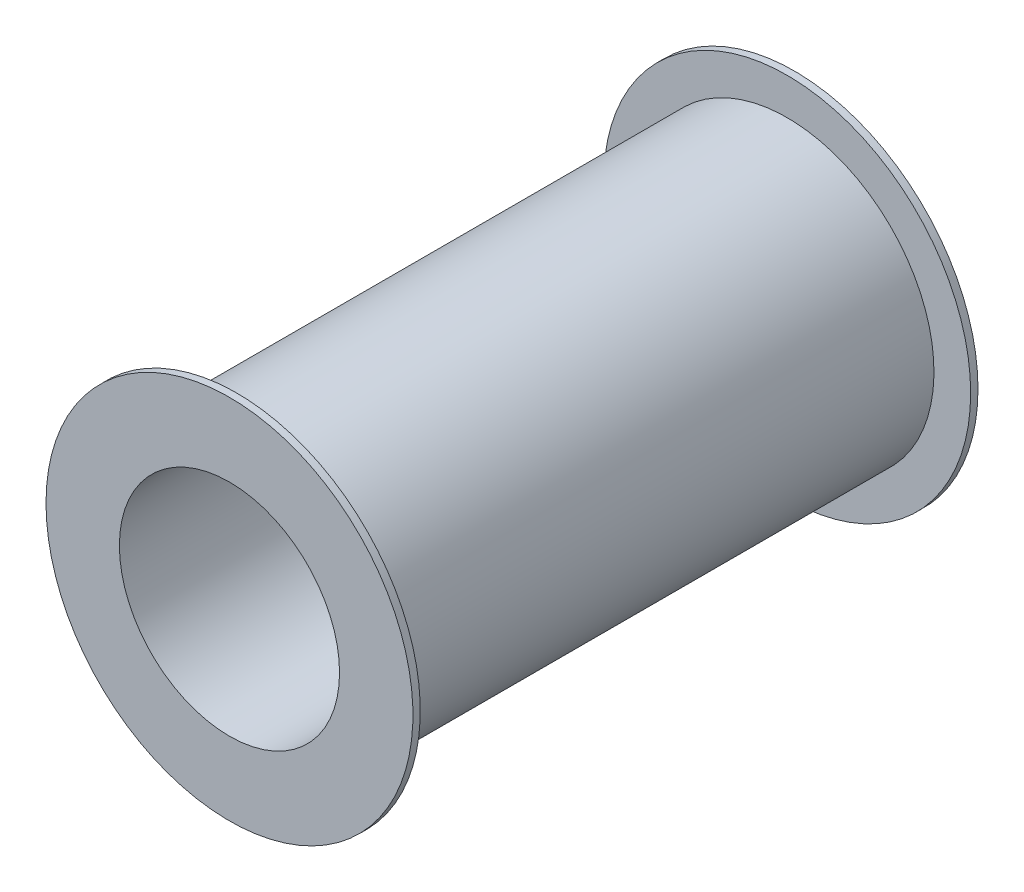
ISO-10303-21;
HEADER;
FILE_DESCRIPTION(('STEP AP214'),'2;1');
FILE_NAME('part.step','',(''),(''),'','','');
FILE_SCHEMA(('AUTOMOTIVE_DESIGN { 1 0 10303 214 1 1 1 1 }'));
ENDSEC;
DATA;
#1=APPLICATION_CONTEXT('core data for automotive mechanical design processes');
#2=APPLICATION_PROTOCOL_DEFINITION('international standard','automotive_design',2000,#1);
#3=PRODUCT_CONTEXT('',#1,'mechanical');
#4=PRODUCT('Part','Part','',(#3));
#5=PRODUCT_RELATED_PRODUCT_CATEGORY('part','',(#4));
#6=PRODUCT_DEFINITION_FORMATION('','',#4);
#7=PRODUCT_DEFINITION_CONTEXT('part definition',#1,'design');
#8=PRODUCT_DEFINITION('design','',#6,#7);
#9=PRODUCT_DEFINITION_SHAPE('','',#8);
#10=(LENGTH_UNIT() NAMED_UNIT(*) SI_UNIT(.MILLI.,.METRE.));
#11=(NAMED_UNIT(*) PLANE_ANGLE_UNIT() SI_UNIT($,.RADIAN.));
#12=(NAMED_UNIT(*) SI_UNIT($,.STERADIAN.) SOLID_ANGLE_UNIT());
#13=UNCERTAINTY_MEASURE_WITH_UNIT(LENGTH_MEASURE(1.E-05),#10,'distance_accuracy_value','');
#14=(GEOMETRIC_REPRESENTATION_CONTEXT(3) GLOBAL_UNCERTAINTY_ASSIGNED_CONTEXT((#13)) GLOBAL_UNIT_ASSIGNED_CONTEXT((#10,
#11,#12)) REPRESENTATION_CONTEXT('',''));
#15=CARTESIAN_POINT('',(0.,0.,0.));
#16=DIRECTION('',(0.,0.,1.));
#17=DIRECTION('',(1.,0.,0.));
#18=AXIS2_PLACEMENT_3D('',#15,#16,#17);
#19=CARTESIAN_POINT('',(8.125,-4.2,-7.02));
#20=DIRECTION('',(0.,0.,1.));
#21=DIRECTION('',(1.,0.,0.));
#22=AXIS2_PLACEMENT_3D('',#19,#20,#21);
#23=CYLINDRICAL_SURFACE('',#22,0.5);
#24=CARTESIAN_POINT('',(8.125,-4.2,-7.));
#25=DIRECTION('',(0.,0.,1.));
#26=DIRECTION('',(1.,0.,0.));
#27=AXIS2_PLACEMENT_3D('',#24,#25,#26);
#28=CIRCLE('',#27,0.5);
#29=CARTESIAN_POINT('',(8.625,-4.2,-7.));
#30=VERTEX_POINT('',#29);
#31=EDGE_CURVE('E41',#30,#30,#28,.T.);
#32=ORIENTED_EDGE('',*,*,#31,.F.);
#33=EDGE_LOOP('',(#32));
#34=FACE_BOUND('',#33,.T.);
#35=CARTESIAN_POINT('',(8.125,-4.2,-7.02));
#36=DIRECTION('',(0.,0.,1.));
#37=DIRECTION('',(1.,0.,0.));
#38=AXIS2_PLACEMENT_3D('',#35,#36,#37);
#39=CIRCLE('',#38,0.5);
#40=CARTESIAN_POINT('',(8.625,-4.2,-7.02));
#41=VERTEX_POINT('',#40);
#42=EDGE_CURVE('E19',#41,#41,#39,.F.);
#43=ORIENTED_EDGE('',*,*,#42,.F.);
#44=EDGE_LOOP('',(#43));
#45=FACE_BOUND('',#44,.T.);
#46=ADVANCED_FACE('F15',(#34,#45),#23,.T.);
#47=CARTESIAN_POINT('',(7.624,-3.699,-7.02));
#48=DIRECTION('',(0.,0.,-1.));
#49=DIRECTION('',(1.,0.,0.));
#50=AXIS2_PLACEMENT_3D('',#47,#48,#49);
#51=PLANE('',#50);
#52=CARTESIAN_POINT('',(8.12500000000001,-4.2,-7.02));
#53=DIRECTION('',(0.,0.,-1.));
#54=DIRECTION('',(-1.,0.,0.));
#55=AXIS2_PLACEMENT_3D('',#52,#53,#54);
#56=CIRCLE('',#55,0.299999999999995);
#57=CARTESIAN_POINT('',(7.82500000000002,-4.2,-7.02));
#58=VERTEX_POINT('',#57);
#59=EDGE_CURVE('E39',#58,#58,#56,.T.);
#60=ORIENTED_EDGE('',*,*,#59,.F.);
#61=EDGE_LOOP('',(#60));
#62=FACE_BOUND('',#61,.T.);
#63=ORIENTED_EDGE('',*,*,#42,.T.);
#64=EDGE_LOOP('',(#63));
#65=FACE_BOUND('',#64,.T.);
#66=ADVANCED_FACE('F48',(#62,#65),#51,.T.);
#67=CARTESIAN_POINT('',(8.626,-3.699,-7.));
#68=DIRECTION('',(0.,0.,1.));
#69=DIRECTION('',(-1.,0.,0.));
#70=AXIS2_PLACEMENT_3D('',#67,#68,#69);
#71=PLANE('',#70);
#72=CARTESIAN_POINT('',(8.12500000000001,-4.2,-7.));
#73=DIRECTION('',(0.,0.,1.));
#74=DIRECTION('',(0.,-1.,0.));
#75=AXIS2_PLACEMENT_3D('',#72,#73,#74);
#76=CIRCLE('',#75,0.399999999999999);
#77=CARTESIAN_POINT('',(8.12500000000001,-4.6,-7.));
#78=VERTEX_POINT('',#77);
#79=EDGE_CURVE('E36',#78,#78,#76,.T.);
#80=ORIENTED_EDGE('',*,*,#79,.F.);
#81=EDGE_LOOP('',(#80));
#82=FACE_BOUND('',#81,.T.);
#83=ORIENTED_EDGE('',*,*,#31,.T.);
#84=EDGE_LOOP('',(#83));
#85=FACE_BOUND('',#84,.T.);
#86=ADVANCED_FACE('F57',(#82,#85),#71,.T.);
#87=CARTESIAN_POINT('',(8.12500000000001,-4.2,-5.48));
#88=DIRECTION('',(0.,0.,-1.));
#89=DIRECTION('',(-1.,0.,0.));
#90=AXIS2_PLACEMENT_3D('',#87,#88,#89);
#91=CYLINDRICAL_SURFACE('',#90,0.299999999999995);
#92=ORIENTED_EDGE('',*,*,#59,.T.);
#93=EDGE_LOOP('',(#92));
#94=FACE_BOUND('',#93,.T.);
#95=CARTESIAN_POINT('',(8.12500000000001,-4.2,-5.48));
#96=DIRECTION('',(0.,0.,-1.));
#97=DIRECTION('',(-1.,0.,0.));
#98=AXIS2_PLACEMENT_3D('',#95,#96,#97);
#99=CIRCLE('',#98,0.299999999999995);
#100=CARTESIAN_POINT('',(7.82500000000002,-4.2,-5.48));
#101=VERTEX_POINT('',#100);
#102=EDGE_CURVE('E33',#101,#101,#99,.T.);
#103=ORIENTED_EDGE('',*,*,#102,.F.);
#104=EDGE_LOOP('',(#103));
#105=FACE_BOUND('',#104,.T.);
#106=ADVANCED_FACE('F77',(#94,#105),#91,.F.);
#107=CARTESIAN_POINT('',(8.12500000000001,-4.2,-7.));
#108=DIRECTION('',(0.,0.,1.));
#109=DIRECTION('',(0.,-1.,0.));
#110=AXIS2_PLACEMENT_3D('',#107,#108,#109);
#111=CYLINDRICAL_SURFACE('',#110,0.399999999999999);
#112=CARTESIAN_POINT('',(8.125,-4.2,-5.5));
#113=DIRECTION('',(0.,0.,1.));
#114=DIRECTION('',(0.,-1.,0.));
#115=AXIS2_PLACEMENT_3D('',#112,#113,#114);
#116=CIRCLE('',#115,0.399999999999999);
#117=CARTESIAN_POINT('',(8.125,-4.59999999999999,-5.5));
#118=VERTEX_POINT('',#117);
#119=EDGE_CURVE('E28',#118,#118,#116,.T.);
#120=ORIENTED_EDGE('',*,*,#119,.F.);
#121=EDGE_LOOP('',(#120));
#122=FACE_BOUND('',#121,.T.);
#123=ORIENTED_EDGE('',*,*,#79,.T.);
#124=EDGE_LOOP('',(#123));
#125=FACE_BOUND('',#124,.T.);
#126=ADVANCED_FACE('F71',(#122,#125),#111,.T.);
#127=CARTESIAN_POINT('',(7.624,-4.701,-5.48));
#128=DIRECTION('',(0.,0.,1.));
#129=DIRECTION('',(1.,0.,0.));
#130=AXIS2_PLACEMENT_3D('',#127,#128,#129);
#131=PLANE('',#130);
#132=ORIENTED_EDGE('',*,*,#102,.T.);
#133=EDGE_LOOP('',(#132));
#134=FACE_BOUND('',#133,.T.);
#135=CARTESIAN_POINT('',(8.125,-4.2,-5.48));
#136=DIRECTION('',(0.,0.,-1.));
#137=DIRECTION('',(-1.,0.,0.));
#138=AXIS2_PLACEMENT_3D('',#135,#136,#137);
#139=CIRCLE('',#138,0.5);
#140=CARTESIAN_POINT('',(7.625,-4.2,-5.48));
#141=VERTEX_POINT('',#140);
#142=EDGE_CURVE('E23',#141,#141,#139,.T.);
#143=ORIENTED_EDGE('',*,*,#142,.F.);
#144=EDGE_LOOP('',(#143));
#145=FACE_BOUND('',#144,.T.);
#146=ADVANCED_FACE('F65',(#134,#145),#131,.T.);
#147=CARTESIAN_POINT('',(8.626,-4.701,-5.5));
#148=DIRECTION('',(0.,0.,-1.));
#149=DIRECTION('',(-1.,0.,0.));
#150=AXIS2_PLACEMENT_3D('',#147,#148,#149);
#151=PLANE('',#150);
#152=ORIENTED_EDGE('',*,*,#119,.T.);
#153=EDGE_LOOP('',(#152));
#154=FACE_BOUND('',#153,.T.);
#155=CARTESIAN_POINT('',(8.125,-4.2,-5.5));
#156=DIRECTION('',(0.,0.,-1.));
#157=DIRECTION('',(-1.,0.,0.));
#158=AXIS2_PLACEMENT_3D('',#155,#156,#157);
#159=CIRCLE('',#158,0.5);
#160=CARTESIAN_POINT('',(7.625,-4.2,-5.5));
#161=VERTEX_POINT('',#160);
#162=EDGE_CURVE('E10',#161,#161,#159,.F.);
#163=ORIENTED_EDGE('',*,*,#162,.F.);
#164=EDGE_LOOP('',(#163));
#165=FACE_BOUND('',#164,.T.);
#166=ADVANCED_FACE('F61',(#154,#165),#151,.T.);
#167=CARTESIAN_POINT('',(8.125,-4.2,-5.48));
#168=DIRECTION('',(0.,0.,-1.));
#169=DIRECTION('',(-1.,0.,0.));
#170=AXIS2_PLACEMENT_3D('',#167,#168,#169);
#171=CYLINDRICAL_SURFACE('',#170,0.5);
#172=ORIENTED_EDGE('',*,*,#162,.T.);
#173=EDGE_LOOP('',(#172));
#174=FACE_BOUND('',#173,.T.);
#175=ORIENTED_EDGE('',*,*,#142,.T.);
#176=EDGE_LOOP('',(#175));
#177=FACE_BOUND('',#176,.T.);
#178=ADVANCED_FACE('F17',(#174,#177),#171,.T.);
#179=CLOSED_SHELL('',(#46,#66,#86,#106,#126,#146,#166,#178));
#180=MANIFOLD_SOLID_BREP('B1',#179);
#181=ADVANCED_BREP_SHAPE_REPRESENTATION('',(#18,#180),#14);
#182=SHAPE_DEFINITION_REPRESENTATION(#9,#181);
ENDSEC;
END-ISO-10303-21;
